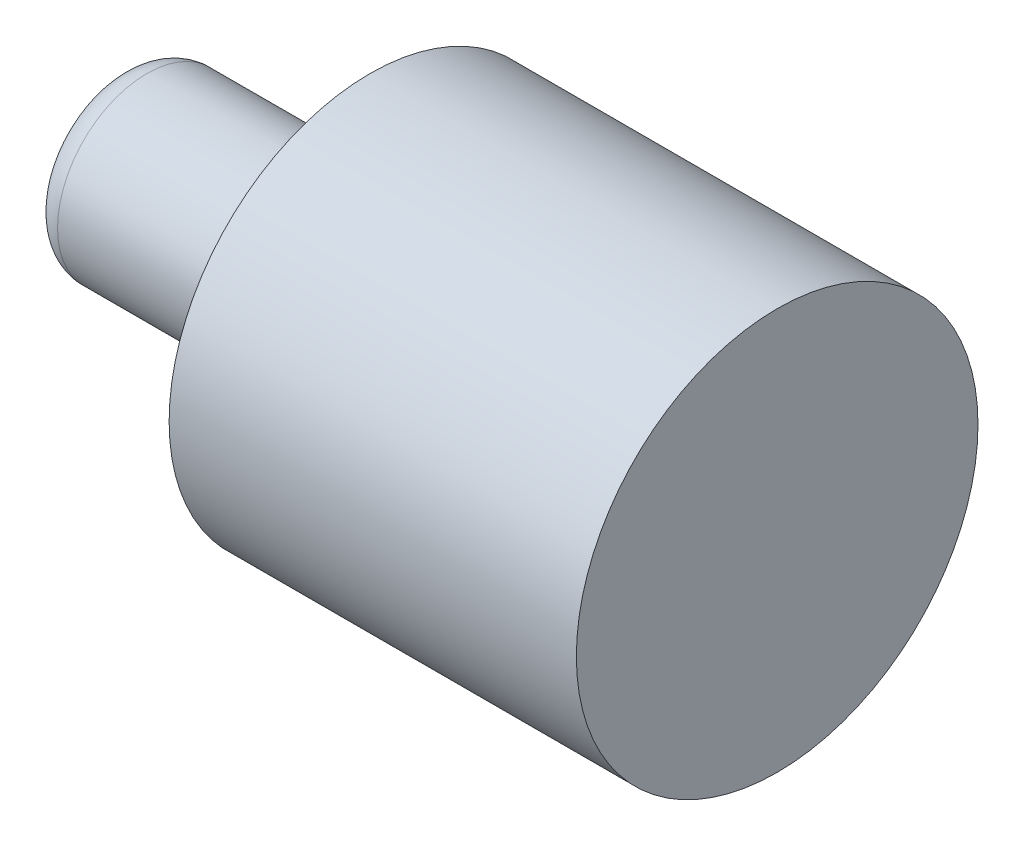
ISO-10303-21;
HEADER;
FILE_DESCRIPTION(('STEP AP214'),'2;1');
FILE_NAME('part.step','',(''),(''),'','','');
FILE_SCHEMA(('AUTOMOTIVE_DESIGN { 1 0 10303 214 1 1 1 1 }'));
ENDSEC;
DATA;
#1=APPLICATION_CONTEXT('core data for automotive mechanical design processes');
#2=APPLICATION_PROTOCOL_DEFINITION('international standard','automotive_design',2000,#1);
#3=PRODUCT_CONTEXT('',#1,'mechanical');
#4=PRODUCT('Part','Part','',(#3));
#5=PRODUCT_RELATED_PRODUCT_CATEGORY('part','',(#4));
#6=PRODUCT_DEFINITION_FORMATION('','',#4);
#7=PRODUCT_DEFINITION_CONTEXT('part definition',#1,'design');
#8=PRODUCT_DEFINITION('design','',#6,#7);
#9=PRODUCT_DEFINITION_SHAPE('','',#8);
#10=(LENGTH_UNIT() NAMED_UNIT(*) SI_UNIT(.MILLI.,.METRE.));
#11=(NAMED_UNIT(*) PLANE_ANGLE_UNIT() SI_UNIT($,.RADIAN.));
#12=(NAMED_UNIT(*) SI_UNIT($,.STERADIAN.) SOLID_ANGLE_UNIT());
#13=UNCERTAINTY_MEASURE_WITH_UNIT(LENGTH_MEASURE(1.E-05),#10,'distance_accuracy_value','');
#14=(GEOMETRIC_REPRESENTATION_CONTEXT(3) GLOBAL_UNCERTAINTY_ASSIGNED_CONTEXT((#13)) GLOBAL_UNIT_ASSIGNED_CONTEXT((#10,
#11,#12)) REPRESENTATION_CONTEXT('',''));
#15=CARTESIAN_POINT('',(0.,0.,0.));
#16=DIRECTION('',(0.,0.,1.));
#17=DIRECTION('',(1.,0.,0.));
#18=AXIS2_PLACEMENT_3D('',#15,#16,#17);
#19=CARTESIAN_POINT('',(80.,0.,0.));
#20=DIRECTION('',(-1.,0.,0.));
#21=DIRECTION('',(0.,0.,1.));
#22=AXIS2_PLACEMENT_3D('',#19,#20,#21);
#23=CYLINDRICAL_SURFACE('',#22,16.);
#24=CARTESIAN_POINT('',(5.,0.,0.));
#25=DIRECTION('',(1.,0.,0.));
#26=DIRECTION('',(0.,0.,-1.));
#27=AXIS2_PLACEMENT_3D('',#24,#25,#26);
#28=CIRCLE('',#27,16.);
#29=CARTESIAN_POINT('',(5.,0.,-16.));
#30=VERTEX_POINT('',#29);
#31=EDGE_CURVE('E44',#30,#30,#28,.T.);
#32=ORIENTED_EDGE('',*,*,#31,.T.);
#33=EDGE_LOOP('',(#32));
#34=FACE_BOUND('',#33,.T.);
#35=CARTESIAN_POINT('',(40.,0.,0.));
#36=DIRECTION('',(-1.,0.,0.));
#37=DIRECTION('',(0.,0.,1.));
#38=AXIS2_PLACEMENT_3D('',#35,#36,#37);
#39=CIRCLE('',#38,16.);
#40=CARTESIAN_POINT('',(40.,0.,16.));
#41=VERTEX_POINT('',#40);
#42=EDGE_CURVE('E48',#41,#41,#39,.T.);
#43=ORIENTED_EDGE('',*,*,#42,.T.);
#44=EDGE_LOOP('',(#43));
#45=FACE_BOUND('',#44,.T.);
#46=ADVANCED_FACE('F33',(#34,#45),#23,.T.);
#47=CARTESIAN_POINT('',(0.,0.,0.));
#48=DIRECTION('',(1.,0.,0.));
#49=DIRECTION('',(0.,0.,-1.));
#50=AXIS2_PLACEMENT_3D('',#47,#48,#49);
#51=PLANE('',#50);
#52=CARTESIAN_POINT('',(0.,0.,0.));
#53=DIRECTION('',(1.,0.,0.));
#54=DIRECTION('',(0.,0.,-1.));
#55=AXIS2_PLACEMENT_3D('',#52,#53,#54);
#56=CIRCLE('',#55,11.);
#57=CARTESIAN_POINT('',(0.,0.,-11.));
#58=VERTEX_POINT('',#57);
#59=EDGE_CURVE('E40',#58,#58,#56,.F.);
#60=ORIENTED_EDGE('',*,*,#59,.T.);
#61=EDGE_LOOP('',(#60));
#62=FACE_BOUND('',#61,.T.);
#63=ADVANCED_FACE('F78',(#62),#51,.F.);
#64=CARTESIAN_POINT('',(45.,0.,0.));
#65=DIRECTION('',(-1.,0.,0.));
#66=DIRECTION('',(0.,0.,1.));
#67=AXIS2_PLACEMENT_3D('',#64,#65,#66);
#68=PLANE('',#67);
#69=CARTESIAN_POINT('',(45.,0.,0.));
#70=DIRECTION('',(-1.,0.,0.));
#71=DIRECTION('',(0.,0.,1.));
#72=AXIS2_PLACEMENT_3D('',#69,#70,#71);
#73=CIRCLE('',#72,21.);
#74=CARTESIAN_POINT('',(45.,0.,21.));
#75=VERTEX_POINT('',#74);
#76=EDGE_CURVE('E10',#75,#75,#73,.F.);
#77=ORIENTED_EDGE('',*,*,#76,.T.);
#78=EDGE_LOOP('',(#77));
#79=FACE_BOUND('',#78,.T.);
#80=CARTESIAN_POINT('',(45.,0.,0.));
#81=DIRECTION('',(-1.,0.,0.));
#82=DIRECTION('',(0.,0.,1.));
#83=AXIS2_PLACEMENT_3D('',#80,#81,#82);
#84=CIRCLE('',#83,36.);
#85=CARTESIAN_POINT('',(45.,0.,36.));
#86=VERTEX_POINT('',#85);
#87=EDGE_CURVE('E56',#86,#86,#84,.T.);
#88=ORIENTED_EDGE('',*,*,#87,.T.);
#89=EDGE_LOOP('',(#88));
#90=FACE_BOUND('',#89,.T.);
#91=ADVANCED_FACE('F60',(#79,#90),#68,.T.);
#92=CARTESIAN_POINT('',(118.,0.,0.));
#93=DIRECTION('',(1.,0.,0.));
#94=DIRECTION('',(0.,0.,-1.));
#95=AXIS2_PLACEMENT_3D('',#92,#93,#94);
#96=PLANE('',#95);
#97=CARTESIAN_POINT('',(118.,0.,0.));
#98=DIRECTION('',(1.,0.,0.));
#99=DIRECTION('',(0.,0.,-1.));
#100=AXIS2_PLACEMENT_3D('',#97,#98,#99);
#101=CIRCLE('',#100,36.);
#102=CARTESIAN_POINT('',(118.,0.,-36.));
#103=VERTEX_POINT('',#102);
#104=EDGE_CURVE('E53',#103,#103,#101,.T.);
#105=ORIENTED_EDGE('',*,*,#104,.T.);
#106=EDGE_LOOP('',(#105));
#107=FACE_BOUND('',#106,.T.);
#108=ADVANCED_FACE('F65',(#107),#96,.T.);
#109=CARTESIAN_POINT('',(118.,0.,0.));
#110=DIRECTION('',(-1.,0.,0.));
#111=DIRECTION('',(0.,0.,1.));
#112=AXIS2_PLACEMENT_3D('',#109,#110,#111);
#113=CYLINDRICAL_SURFACE('',#112,36.);
#114=ORIENTED_EDGE('',*,*,#104,.F.);
#115=EDGE_LOOP('',(#114));
#116=FACE_BOUND('',#115,.T.);
#117=ORIENTED_EDGE('',*,*,#87,.F.);
#118=EDGE_LOOP('',(#117));
#119=FACE_BOUND('',#118,.T.);
#120=ADVANCED_FACE('F62',(#116,#119),#113,.T.);
#121=CARTESIAN_POINT('',(5.,0.,0.));
#122=DIRECTION('',(1.,0.,0.));
#123=DIRECTION('',(0.,0.,-1.));
#124=AXIS2_PLACEMENT_3D('',#121,#122,#123);
#125=TOROIDAL_SURFACE('',#124,11.,5.);
#126=ORIENTED_EDGE('',*,*,#59,.F.);
#127=EDGE_LOOP('',(#126));
#128=FACE_BOUND('',#127,.T.);
#129=ORIENTED_EDGE('',*,*,#31,.F.);
#130=EDGE_LOOP('',(#129));
#131=FACE_BOUND('',#130,.T.);
#132=ADVANCED_FACE('F64',(#128,#131),#125,.T.);
#133=CARTESIAN_POINT('',(40.,0.,0.));
#134=DIRECTION('',(-1.,0.,0.));
#135=DIRECTION('',(0.,0.,1.));
#136=AXIS2_PLACEMENT_3D('',#133,#134,#135);
#137=TOROIDAL_SURFACE('',#136,21.,5.);
#138=ORIENTED_EDGE('',*,*,#76,.F.);
#139=EDGE_LOOP('',(#138));
#140=FACE_BOUND('',#139,.T.);
#141=ORIENTED_EDGE('',*,*,#42,.F.);
#142=EDGE_LOOP('',(#141));
#143=FACE_BOUND('',#142,.T.);
#144=ADVANCED_FACE('F35',(#140,#143),#137,.F.);
#145=CLOSED_SHELL('',(#46,#63,#91,#108,#120,#132,#144));
#146=MANIFOLD_SOLID_BREP('B2',#145);
#147=ADVANCED_BREP_SHAPE_REPRESENTATION('',(#18,#146),#14);
#148=SHAPE_DEFINITION_REPRESENTATION(#9,#147);
ENDSEC;
END-ISO-10303-21;
